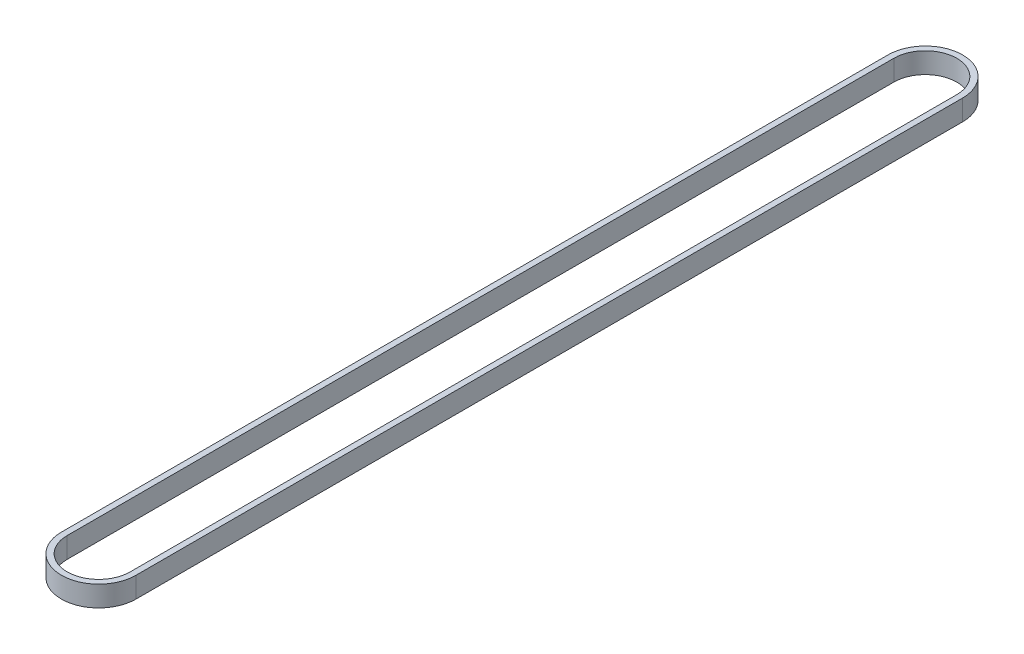
ISO-10303-21;
HEADER;
FILE_DESCRIPTION(('STEP AP214'),'2;1');
FILE_NAME('part.step','',(''),(''),'','','');
FILE_SCHEMA(('AUTOMOTIVE_DESIGN { 1 0 10303 214 1 1 1 1 }'));
ENDSEC;
DATA;
#1=APPLICATION_CONTEXT('core data for automotive mechanical design processes');
#2=APPLICATION_PROTOCOL_DEFINITION('international standard','automotive_design',2000,#1);
#3=PRODUCT_CONTEXT('',#1,'mechanical');
#4=PRODUCT('Part','Part','',(#3));
#5=PRODUCT_RELATED_PRODUCT_CATEGORY('part','',(#4));
#6=PRODUCT_DEFINITION_FORMATION('','',#4);
#7=PRODUCT_DEFINITION_CONTEXT('part definition',#1,'design');
#8=PRODUCT_DEFINITION('design','',#6,#7);
#9=PRODUCT_DEFINITION_SHAPE('','',#8);
#10=(LENGTH_UNIT() NAMED_UNIT(*) SI_UNIT(.MILLI.,.METRE.));
#11=(NAMED_UNIT(*) PLANE_ANGLE_UNIT() SI_UNIT($,.RADIAN.));
#12=(NAMED_UNIT(*) SI_UNIT($,.STERADIAN.) SOLID_ANGLE_UNIT());
#13=UNCERTAINTY_MEASURE_WITH_UNIT(LENGTH_MEASURE(1.E-05),#10,'distance_accuracy_value','');
#14=(GEOMETRIC_REPRESENTATION_CONTEXT(3) GLOBAL_UNCERTAINTY_ASSIGNED_CONTEXT((#13)) GLOBAL_UNIT_ASSIGNED_CONTEXT((#10,
#11,#12)) REPRESENTATION_CONTEXT('',''));
#15=CARTESIAN_POINT('',(0.,0.,0.));
#16=DIRECTION('',(0.,0.,1.));
#17=DIRECTION('',(1.,0.,0.));
#18=AXIS2_PLACEMENT_3D('',#15,#16,#17);
#19=CARTESIAN_POINT('',(0.,9.,-360.));
#20=DIRECTION('',(0.,1.,0.));
#21=DIRECTION('',(0.,0.,1.));
#22=AXIS2_PLACEMENT_3D('',#19,#20,#21);
#23=PLANE('',#22);
#24=CARTESIAN_POINT('',(0.,9.,-360.));
#25=DIRECTION('',(0.,1.,0.));
#26=DIRECTION('',(0.,0.,1.));
#27=AXIS2_PLACEMENT_3D('',#24,#25,#26);
#28=CIRCLE('',#27,16.256);
#29=CARTESIAN_POINT('',(16.256,9.,-360.));
#30=VERTEX_POINT('',#29);
#31=CARTESIAN_POINT('',(-16.256,9.,-360.));
#32=VERTEX_POINT('',#31);
#33=EDGE_CURVE('E136',#30,#32,#28,.T.);
#34=ORIENTED_EDGE('',*,*,#33,.T.);
#35=DIRECTION('',(0.,0.,1.));
#36=VECTOR('',#35,1.);
#37=CARTESIAN_POINT('',(-16.256,9.,-360.));
#38=LINE('',#37,#36);
#39=CARTESIAN_POINT('',(-16.256,9.,0.));
#40=VERTEX_POINT('',#39);
#41=EDGE_CURVE('E139',#32,#40,#38,.T.);
#42=ORIENTED_EDGE('',*,*,#41,.T.);
#43=CARTESIAN_POINT('',(0.,9.,0.));
#44=DIRECTION('',(0.,1.,0.));
#45=DIRECTION('',(0.,0.,1.));
#46=AXIS2_PLACEMENT_3D('',#43,#44,#45);
#47=CIRCLE('',#46,16.256);
#48=CARTESIAN_POINT('',(16.256,9.,0.));
#49=VERTEX_POINT('',#48);
#50=EDGE_CURVE('E142',#40,#49,#47,.T.);
#51=ORIENTED_EDGE('',*,*,#50,.T.);
#52=DIRECTION('',(0.,0.,-1.));
#53=VECTOR('',#52,1.);
#54=CARTESIAN_POINT('',(16.256,9.,-360.));
#55=LINE('',#54,#53);
#56=EDGE_CURVE('E144',#49,#30,#55,.T.);
#57=ORIENTED_EDGE('',*,*,#56,.T.);
#58=EDGE_LOOP('',(#34,#42,#51,#57));
#59=FACE_BOUND('',#58,.T.);
#60=DIRECTION('',(0.,0.,1.));
#61=VECTOR('',#60,1.);
#62=CARTESIAN_POINT('',(-13.716,9.,-360.));
#63=LINE('',#62,#61);
#64=CARTESIAN_POINT('',(-13.716,9.,-360.));
#65=VERTEX_POINT('',#64);
#66=CARTESIAN_POINT('',(-13.7160000000001,9.,0.));
#67=VERTEX_POINT('',#66);
#68=EDGE_CURVE('E108',#65,#67,#63,.T.);
#69=ORIENTED_EDGE('',*,*,#68,.F.);
#70=CARTESIAN_POINT('',(0.,9.,-360.));
#71=DIRECTION('',(0.,1.,0.));
#72=DIRECTION('',(0.,0.,1.));
#73=AXIS2_PLACEMENT_3D('',#70,#71,#72);
#74=CIRCLE('',#73,13.716);
#75=CARTESIAN_POINT('',(13.716,9.,-360.));
#76=VERTEX_POINT('',#75);
#77=EDGE_CURVE('E100',#76,#65,#74,.T.);
#78=ORIENTED_EDGE('',*,*,#77,.F.);
#79=DIRECTION('',(0.,0.,-1.));
#80=VECTOR('',#79,1.);
#81=CARTESIAN_POINT('',(13.716,9.,-360.));
#82=LINE('',#81,#80);
#83=CARTESIAN_POINT('',(13.7160000000001,9.,0.));
#84=VERTEX_POINT('',#83);
#85=EDGE_CURVE('E122',#84,#76,#82,.T.);
#86=ORIENTED_EDGE('',*,*,#85,.F.);
#87=CARTESIAN_POINT('',(0.,9.,0.));
#88=DIRECTION('',(0.,1.,0.));
#89=DIRECTION('',(0.,0.,1.));
#90=AXIS2_PLACEMENT_3D('',#87,#88,#89);
#91=CIRCLE('',#90,13.7160000000001);
#92=EDGE_CURVE('E120',#67,#84,#91,.T.);
#93=ORIENTED_EDGE('',*,*,#92,.F.);
#94=EDGE_LOOP('',(#69,#78,#86,#93));
#95=FACE_BOUND('',#94,.T.);
#96=ADVANCED_FACE('F35',(#59,#95),#23,.T.);
#97=CARTESIAN_POINT('',(0.,0.,-360.));
#98=DIRECTION('',(0.,1.,0.));
#99=DIRECTION('',(0.,0.,1.));
#100=AXIS2_PLACEMENT_3D('',#97,#98,#99);
#101=PLANE('',#100);
#102=CARTESIAN_POINT('',(0.,0.,-360.));
#103=DIRECTION('',(0.,1.,0.));
#104=DIRECTION('',(0.,0.,1.));
#105=AXIS2_PLACEMENT_3D('',#102,#103,#104);
#106=CIRCLE('',#105,16.256);
#107=CARTESIAN_POINT('',(16.256,0.,-360.));
#108=VERTEX_POINT('',#107);
#109=CARTESIAN_POINT('',(-16.256,0.,-360.));
#110=VERTEX_POINT('',#109);
#111=EDGE_CURVE('E116',#108,#110,#106,.T.);
#112=ORIENTED_EDGE('',*,*,#111,.F.);
#113=DIRECTION('',(0.,0.,-1.));
#114=VECTOR('',#113,1.);
#115=CARTESIAN_POINT('',(16.256,0.,-360.));
#116=LINE('',#115,#114);
#117=CARTESIAN_POINT('',(16.256,0.,0.));
#118=VERTEX_POINT('',#117);
#119=EDGE_CURVE('E140',#118,#108,#116,.T.);
#120=ORIENTED_EDGE('',*,*,#119,.F.);
#121=CARTESIAN_POINT('',(0.,0.,0.));
#122=DIRECTION('',(0.,1.,0.));
#123=DIRECTION('',(0.,0.,1.));
#124=AXIS2_PLACEMENT_3D('',#121,#122,#123);
#125=CIRCLE('',#124,16.256);
#126=CARTESIAN_POINT('',(-16.256,0.,0.));
#127=VERTEX_POINT('',#126);
#128=EDGE_CURVE('E151',#127,#118,#125,.T.);
#129=ORIENTED_EDGE('',*,*,#128,.F.);
#130=DIRECTION('',(0.,0.,1.));
#131=VECTOR('',#130,1.);
#132=CARTESIAN_POINT('',(-16.256,0.,-360.));
#133=LINE('',#132,#131);
#134=EDGE_CURVE('E149',#110,#127,#133,.T.);
#135=ORIENTED_EDGE('',*,*,#134,.F.);
#136=EDGE_LOOP('',(#112,#120,#129,#135));
#137=FACE_BOUND('',#136,.T.);
#138=CARTESIAN_POINT('',(0.,0.,-360.));
#139=DIRECTION('',(0.,1.,0.));
#140=DIRECTION('',(0.,0.,1.));
#141=AXIS2_PLACEMENT_3D('',#138,#139,#140);
#142=CIRCLE('',#141,13.716);
#143=CARTESIAN_POINT('',(13.716,0.,-360.));
#144=VERTEX_POINT('',#143);
#145=CARTESIAN_POINT('',(-13.716,0.,-360.));
#146=VERTEX_POINT('',#145);
#147=EDGE_CURVE('E58',#144,#146,#142,.T.);
#148=ORIENTED_EDGE('',*,*,#147,.T.);
#149=DIRECTION('',(0.,0.,1.));
#150=VECTOR('',#149,1.);
#151=CARTESIAN_POINT('',(-13.716,0.,-360.));
#152=LINE('',#151,#150);
#153=CARTESIAN_POINT('',(-13.7160000000001,0.,0.));
#154=VERTEX_POINT('',#153);
#155=EDGE_CURVE('E115',#146,#154,#152,.T.);
#156=ORIENTED_EDGE('',*,*,#155,.T.);
#157=CARTESIAN_POINT('',(0.,0.,0.));
#158=DIRECTION('',(0.,1.,0.));
#159=DIRECTION('',(0.,0.,1.));
#160=AXIS2_PLACEMENT_3D('',#157,#158,#159);
#161=CIRCLE('',#160,13.7160000000001);
#162=CARTESIAN_POINT('',(13.7160000000001,0.,0.));
#163=VERTEX_POINT('',#162);
#164=EDGE_CURVE('E128',#154,#163,#161,.T.);
#165=ORIENTED_EDGE('',*,*,#164,.T.);
#166=DIRECTION('',(0.,0.,-1.));
#167=VECTOR('',#166,1.);
#168=CARTESIAN_POINT('',(13.716,0.,-360.));
#169=LINE('',#168,#167);
#170=EDGE_CURVE('E109',#163,#144,#169,.T.);
#171=ORIENTED_EDGE('',*,*,#170,.T.);
#172=EDGE_LOOP('',(#148,#156,#165,#171));
#173=FACE_BOUND('',#172,.T.);
#174=ADVANCED_FACE('F169',(#137,#173),#101,.F.);
#175=CARTESIAN_POINT('',(0.,9.,-360.));
#176=DIRECTION('',(0.,-1.,0.));
#177=DIRECTION('',(0.,0.,-1.));
#178=AXIS2_PLACEMENT_3D('',#175,#176,#177);
#179=CYLINDRICAL_SURFACE('',#178,16.256);
#180=ORIENTED_EDGE('',*,*,#111,.T.);
#181=DIRECTION('',(0.,-1.,0.));
#182=VECTOR('',#181,1.);
#183=CARTESIAN_POINT('',(-16.256,9.,-360.));
#184=LINE('',#183,#182);
#185=EDGE_CURVE('E11',#32,#110,#184,.T.);
#186=ORIENTED_EDGE('',*,*,#185,.F.);
#187=ORIENTED_EDGE('',*,*,#33,.F.);
#188=DIRECTION('',(0.,-1.,0.));
#189=VECTOR('',#188,1.);
#190=CARTESIAN_POINT('',(16.256,9.,-360.));
#191=LINE('',#190,#189);
#192=EDGE_CURVE('E146',#30,#108,#191,.T.);
#193=ORIENTED_EDGE('',*,*,#192,.T.);
#194=EDGE_LOOP('',(#180,#186,#187,#193));
#195=FACE_BOUND('',#194,.T.);
#196=ADVANCED_FACE('F37',(#195),#179,.T.);
#197=CARTESIAN_POINT('',(-16.256,9.,-360.));
#198=DIRECTION('',(1.,0.,0.));
#199=DIRECTION('',(0.,0.,-1.));
#200=AXIS2_PLACEMENT_3D('',#197,#198,#199);
#201=PLANE('',#200);
#202=ORIENTED_EDGE('',*,*,#134,.T.);
#203=DIRECTION('',(0.,-1.,0.));
#204=VECTOR('',#203,1.);
#205=CARTESIAN_POINT('',(-16.256,9.,0.));
#206=LINE('',#205,#204);
#207=EDGE_CURVE('E43',#40,#127,#206,.T.);
#208=ORIENTED_EDGE('',*,*,#207,.F.);
#209=ORIENTED_EDGE('',*,*,#41,.F.);
#210=ORIENTED_EDGE('',*,*,#185,.T.);
#211=EDGE_LOOP('',(#202,#208,#209,#210));
#212=FACE_BOUND('',#211,.T.);
#213=ADVANCED_FACE('F179',(#212),#201,.F.);
#214=CARTESIAN_POINT('',(0.,9.,0.));
#215=DIRECTION('',(0.,-1.,0.));
#216=DIRECTION('',(0.,0.,-1.));
#217=AXIS2_PLACEMENT_3D('',#214,#215,#216);
#218=CYLINDRICAL_SURFACE('',#217,16.256);
#219=ORIENTED_EDGE('',*,*,#128,.T.);
#220=DIRECTION('',(0.,-1.,0.));
#221=VECTOR('',#220,1.);
#222=CARTESIAN_POINT('',(16.256,9.,0.));
#223=LINE('',#222,#221);
#224=EDGE_CURVE('E156',#49,#118,#223,.T.);
#225=ORIENTED_EDGE('',*,*,#224,.F.);
#226=ORIENTED_EDGE('',*,*,#50,.F.);
#227=ORIENTED_EDGE('',*,*,#207,.T.);
#228=EDGE_LOOP('',(#219,#225,#226,#227));
#229=FACE_BOUND('',#228,.T.);
#230=ADVANCED_FACE('F163',(#229),#218,.T.);
#231=CARTESIAN_POINT('',(16.256,9.,-360.));
#232=DIRECTION('',(-1.,0.,0.));
#233=DIRECTION('',(0.,0.,1.));
#234=AXIS2_PLACEMENT_3D('',#231,#232,#233);
#235=PLANE('',#234);
#236=ORIENTED_EDGE('',*,*,#119,.T.);
#237=ORIENTED_EDGE('',*,*,#192,.F.);
#238=ORIENTED_EDGE('',*,*,#56,.F.);
#239=ORIENTED_EDGE('',*,*,#224,.T.);
#240=EDGE_LOOP('',(#236,#237,#238,#239));
#241=FACE_BOUND('',#240,.T.);
#242=ADVANCED_FACE('F173',(#241),#235,.F.);
#243=CARTESIAN_POINT('',(0.,9.,-360.));
#244=DIRECTION('',(0.,-1.,0.));
#245=DIRECTION('',(0.,0.,-1.));
#246=AXIS2_PLACEMENT_3D('',#243,#244,#245);
#247=CYLINDRICAL_SURFACE('',#246,13.716);
#248=ORIENTED_EDGE('',*,*,#147,.F.);
#249=DIRECTION('',(0.,-1.,0.));
#250=VECTOR('',#249,1.);
#251=CARTESIAN_POINT('',(13.716,9.,-360.));
#252=LINE('',#251,#250);
#253=EDGE_CURVE('E104',#76,#144,#252,.T.);
#254=ORIENTED_EDGE('',*,*,#253,.F.);
#255=ORIENTED_EDGE('',*,*,#77,.T.);
#256=DIRECTION('',(0.,-1.,0.));
#257=VECTOR('',#256,1.);
#258=CARTESIAN_POINT('',(-13.716,9.,-360.));
#259=LINE('',#258,#257);
#260=EDGE_CURVE('E103',#65,#146,#259,.T.);
#261=ORIENTED_EDGE('',*,*,#260,.T.);
#262=EDGE_LOOP('',(#248,#254,#255,#261));
#263=FACE_BOUND('',#262,.T.);
#264=ADVANCED_FACE('F102',(#263),#247,.F.);
#265=CARTESIAN_POINT('',(-13.716,9.,-360.));
#266=DIRECTION('',(1.,0.,0.));
#267=DIRECTION('',(0.,0.,-1.));
#268=AXIS2_PLACEMENT_3D('',#265,#266,#267);
#269=PLANE('',#268);
#270=ORIENTED_EDGE('',*,*,#155,.F.);
#271=ORIENTED_EDGE('',*,*,#260,.F.);
#272=ORIENTED_EDGE('',*,*,#68,.T.);
#273=DIRECTION('',(0.,-1.,0.));
#274=VECTOR('',#273,1.);
#275=CARTESIAN_POINT('',(-13.7160000000001,9.,0.));
#276=LINE('',#275,#274);
#277=EDGE_CURVE('E117',#67,#154,#276,.T.);
#278=ORIENTED_EDGE('',*,*,#277,.T.);
#279=EDGE_LOOP('',(#270,#271,#272,#278));
#280=FACE_BOUND('',#279,.T.);
#281=ADVANCED_FACE('F112',(#280),#269,.T.);
#282=CARTESIAN_POINT('',(0.,9.,0.));
#283=DIRECTION('',(0.,-1.,0.));
#284=DIRECTION('',(0.,0.,-1.));
#285=AXIS2_PLACEMENT_3D('',#282,#283,#284);
#286=CYLINDRICAL_SURFACE('',#285,13.7160000000001);
#287=ORIENTED_EDGE('',*,*,#164,.F.);
#288=ORIENTED_EDGE('',*,*,#277,.F.);
#289=ORIENTED_EDGE('',*,*,#92,.T.);
#290=DIRECTION('',(0.,-1.,0.));
#291=VECTOR('',#290,1.);
#292=CARTESIAN_POINT('',(13.7160000000001,9.,0.));
#293=LINE('',#292,#291);
#294=EDGE_CURVE('E50',#84,#163,#293,.T.);
#295=ORIENTED_EDGE('',*,*,#294,.T.);
#296=EDGE_LOOP('',(#287,#288,#289,#295));
#297=FACE_BOUND('',#296,.T.);
#298=ADVANCED_FACE('F202',(#297),#286,.F.);
#299=CARTESIAN_POINT('',(13.716,9.,-360.));
#300=DIRECTION('',(-1.,0.,0.));
#301=DIRECTION('',(0.,0.,1.));
#302=AXIS2_PLACEMENT_3D('',#299,#300,#301);
#303=PLANE('',#302);
#304=ORIENTED_EDGE('',*,*,#170,.F.);
#305=ORIENTED_EDGE('',*,*,#294,.F.);
#306=ORIENTED_EDGE('',*,*,#85,.T.);
#307=ORIENTED_EDGE('',*,*,#253,.T.);
#308=EDGE_LOOP('',(#304,#305,#306,#307));
#309=FACE_BOUND('',#308,.T.);
#310=ADVANCED_FACE('F206',(#309),#303,.T.);
#311=CLOSED_SHELL('',(#96,#174,#196,#213,#230,#242,#264,#281,#298,#310));
#312=MANIFOLD_SOLID_BREP('B2',#311);
#313=ADVANCED_BREP_SHAPE_REPRESENTATION('',(#18,#312),#14);
#314=SHAPE_DEFINITION_REPRESENTATION(#9,#313);
ENDSEC;
END-ISO-10303-21;
